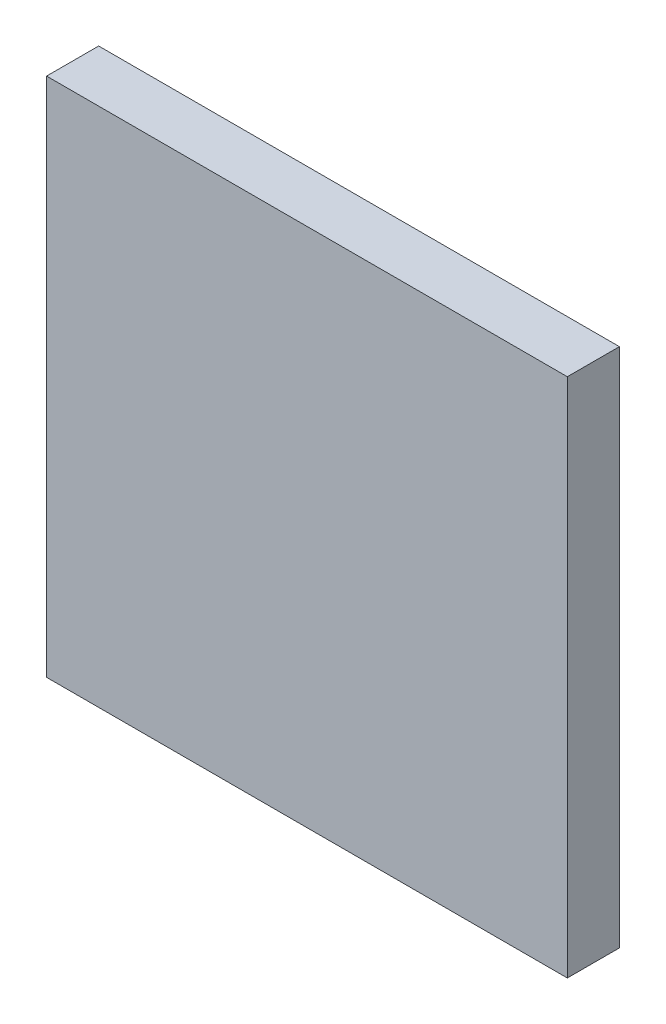
ISO-10303-21;
HEADER;
FILE_DESCRIPTION(('STEP AP214'),'2;1');
FILE_NAME('part.step','',(''),(''),'','','');
FILE_SCHEMA(('AUTOMOTIVE_DESIGN { 1 0 10303 214 1 1 1 1 }'));
ENDSEC;
DATA;
#1=APPLICATION_CONTEXT('core data for automotive mechanical design processes');
#2=APPLICATION_PROTOCOL_DEFINITION('international standard','automotive_design',2000,#1);
#3=PRODUCT_CONTEXT('',#1,'mechanical');
#4=PRODUCT('Part','Part','',(#3));
#5=PRODUCT_RELATED_PRODUCT_CATEGORY('part','',(#4));
#6=PRODUCT_DEFINITION_FORMATION('','',#4);
#7=PRODUCT_DEFINITION_CONTEXT('part definition',#1,'design');
#8=PRODUCT_DEFINITION('design','',#6,#7);
#9=PRODUCT_DEFINITION_SHAPE('','',#8);
#10=(LENGTH_UNIT() NAMED_UNIT(*) SI_UNIT(.MILLI.,.METRE.));
#11=(NAMED_UNIT(*) PLANE_ANGLE_UNIT() SI_UNIT($,.RADIAN.));
#12=(NAMED_UNIT(*) SI_UNIT($,.STERADIAN.) SOLID_ANGLE_UNIT());
#13=UNCERTAINTY_MEASURE_WITH_UNIT(LENGTH_MEASURE(1.E-05),#10,'distance_accuracy_value','');
#14=(GEOMETRIC_REPRESENTATION_CONTEXT(3) GLOBAL_UNCERTAINTY_ASSIGNED_CONTEXT((#13)) GLOBAL_UNIT_ASSIGNED_CONTEXT((#10,
#11,#12)) REPRESENTATION_CONTEXT('',''));
#15=CARTESIAN_POINT('',(0.,0.,0.));
#16=DIRECTION('',(0.,0.,1.));
#17=DIRECTION('',(1.,0.,0.));
#18=AXIS2_PLACEMENT_3D('',#15,#16,#17);
#19=CARTESIAN_POINT('',(10.,0.,1.));
#20=DIRECTION('',(0.,1.,0.));
#21=DIRECTION('',(0.,0.,1.));
#22=AXIS2_PLACEMENT_3D('',#19,#20,#21);
#23=PLANE('',#22);
#24=DIRECTION('',(1.,0.,0.));
#25=VECTOR('',#24,1.);
#26=CARTESIAN_POINT('',(10.,0.,0.));
#27=LINE('',#26,#25);
#28=CARTESIAN_POINT('',(0.,0.,0.));
#29=VERTEX_POINT('',#28);
#30=CARTESIAN_POINT('',(10.,0.,0.));
#31=VERTEX_POINT('',#30);
#32=EDGE_CURVE('E100',#29,#31,#27,.T.);
#33=ORIENTED_EDGE('',*,*,#32,.T.);
#34=DIRECTION('',(0.,0.,-1.));
#35=VECTOR('',#34,1.);
#36=CARTESIAN_POINT('',(10.,0.,1.));
#37=LINE('',#36,#35);
#38=CARTESIAN_POINT('',(10.,0.,1.));
#39=VERTEX_POINT('',#38);
#40=EDGE_CURVE('E11',#39,#31,#37,.T.);
#41=ORIENTED_EDGE('',*,*,#40,.F.);
#42=DIRECTION('',(1.,0.,0.));
#43=VECTOR('',#42,1.);
#44=CARTESIAN_POINT('',(10.,0.,1.));
#45=LINE('',#44,#43);
#46=CARTESIAN_POINT('',(0.,0.,1.));
#47=VERTEX_POINT('',#46);
#48=EDGE_CURVE('E88',#47,#39,#45,.T.);
#49=ORIENTED_EDGE('',*,*,#48,.F.);
#50=DIRECTION('',(0.,0.,-1.));
#51=VECTOR('',#50,1.);
#52=CARTESIAN_POINT('',(0.,0.,1.));
#53=LINE('',#52,#51);
#54=EDGE_CURVE('E96',#47,#29,#53,.T.);
#55=ORIENTED_EDGE('',*,*,#54,.T.);
#56=EDGE_LOOP('',(#33,#41,#49,#55));
#57=FACE_BOUND('',#56,.T.);
#58=ADVANCED_FACE('F37',(#57),#23,.F.);
#59=CARTESIAN_POINT('',(10.,10.,1.));
#60=DIRECTION('',(-1.,0.,0.));
#61=DIRECTION('',(0.,0.,1.));
#62=AXIS2_PLACEMENT_3D('',#59,#60,#61);
#63=PLANE('',#62);
#64=DIRECTION('',(0.,1.,0.));
#65=VECTOR('',#64,1.);
#66=CARTESIAN_POINT('',(10.,10.,0.));
#67=LINE('',#66,#65);
#68=CARTESIAN_POINT('',(10.,10.,0.));
#69=VERTEX_POINT('',#68);
#70=EDGE_CURVE('E92',#31,#69,#67,.T.);
#71=ORIENTED_EDGE('',*,*,#70,.T.);
#72=DIRECTION('',(0.,0.,-1.));
#73=VECTOR('',#72,1.);
#74=CARTESIAN_POINT('',(10.,10.,1.));
#75=LINE('',#74,#73);
#76=CARTESIAN_POINT('',(10.,10.,1.));
#77=VERTEX_POINT('',#76);
#78=EDGE_CURVE('E45',#77,#69,#75,.T.);
#79=ORIENTED_EDGE('',*,*,#78,.F.);
#80=DIRECTION('',(0.,1.,0.));
#81=VECTOR('',#80,1.);
#82=CARTESIAN_POINT('',(10.,10.,1.));
#83=LINE('',#82,#81);
#84=EDGE_CURVE('E83',#39,#77,#83,.T.);
#85=ORIENTED_EDGE('',*,*,#84,.F.);
#86=ORIENTED_EDGE('',*,*,#40,.T.);
#87=EDGE_LOOP('',(#71,#79,#85,#86));
#88=FACE_BOUND('',#87,.T.);
#89=ADVANCED_FACE('F91',(#88),#63,.F.);
#90=CARTESIAN_POINT('',(0.,10.,1.));
#91=DIRECTION('',(0.,-1.,0.));
#92=DIRECTION('',(0.,0.,-1.));
#93=AXIS2_PLACEMENT_3D('',#90,#91,#92);
#94=PLANE('',#93);
#95=DIRECTION('',(-1.,0.,0.));
#96=VECTOR('',#95,1.);
#97=CARTESIAN_POINT('',(0.,10.,0.));
#98=LINE('',#97,#96);
#99=CARTESIAN_POINT('',(0.,10.,0.));
#100=VERTEX_POINT('',#99);
#101=EDGE_CURVE('E70',#69,#100,#98,.T.);
#102=ORIENTED_EDGE('',*,*,#101,.T.);
#103=DIRECTION('',(0.,0.,-1.));
#104=VECTOR('',#103,1.);
#105=CARTESIAN_POINT('',(0.,10.,1.));
#106=LINE('',#105,#104);
#107=CARTESIAN_POINT('',(0.,10.,1.));
#108=VERTEX_POINT('',#107);
#109=EDGE_CURVE('E93',#108,#100,#106,.T.);
#110=ORIENTED_EDGE('',*,*,#109,.F.);
#111=DIRECTION('',(-1.,0.,0.));
#112=VECTOR('',#111,1.);
#113=CARTESIAN_POINT('',(0.,10.,1.));
#114=LINE('',#113,#112);
#115=EDGE_CURVE('E86',#77,#108,#114,.T.);
#116=ORIENTED_EDGE('',*,*,#115,.F.);
#117=ORIENTED_EDGE('',*,*,#78,.T.);
#118=EDGE_LOOP('',(#102,#110,#116,#117));
#119=FACE_BOUND('',#118,.T.);
#120=ADVANCED_FACE('F94',(#119),#94,.F.);
#121=CARTESIAN_POINT('',(0.,0.,1.));
#122=DIRECTION('',(1.,0.,0.));
#123=DIRECTION('',(0.,0.,-1.));
#124=AXIS2_PLACEMENT_3D('',#121,#122,#123);
#125=PLANE('',#124);
#126=DIRECTION('',(0.,-1.,0.));
#127=VECTOR('',#126,1.);
#128=CARTESIAN_POINT('',(0.,0.,0.));
#129=LINE('',#128,#127);
#130=EDGE_CURVE('E76',#100,#29,#129,.T.);
#131=ORIENTED_EDGE('',*,*,#130,.T.);
#132=ORIENTED_EDGE('',*,*,#54,.F.);
#133=DIRECTION('',(0.,-1.,0.));
#134=VECTOR('',#133,1.);
#135=CARTESIAN_POINT('',(0.,0.,1.));
#136=LINE('',#135,#134);
#137=EDGE_CURVE('E53',#108,#47,#136,.T.);
#138=ORIENTED_EDGE('',*,*,#137,.F.);
#139=ORIENTED_EDGE('',*,*,#109,.T.);
#140=EDGE_LOOP('',(#131,#132,#138,#139));
#141=FACE_BOUND('',#140,.T.);
#142=ADVANCED_FACE('F107',(#141),#125,.F.);
#143=CARTESIAN_POINT('',(0.,0.,1.));
#144=DIRECTION('',(0.,0.,-1.));
#145=DIRECTION('',(-1.,0.,0.));
#146=AXIS2_PLACEMENT_3D('',#143,#144,#145);
#147=PLANE('',#146);
#148=ORIENTED_EDGE('',*,*,#48,.T.);
#149=ORIENTED_EDGE('',*,*,#84,.T.);
#150=ORIENTED_EDGE('',*,*,#115,.T.);
#151=ORIENTED_EDGE('',*,*,#137,.T.);
#152=EDGE_LOOP('',(#148,#149,#150,#151));
#153=FACE_BOUND('',#152,.T.);
#154=ADVANCED_FACE('F84',(#153),#147,.F.);
#155=CARTESIAN_POINT('',(0.,0.,0.));
#156=DIRECTION('',(0.,0.,-1.));
#157=DIRECTION('',(-1.,0.,0.));
#158=AXIS2_PLACEMENT_3D('',#155,#156,#157);
#159=PLANE('',#158);
#160=ORIENTED_EDGE('',*,*,#32,.F.);
#161=ORIENTED_EDGE('',*,*,#130,.F.);
#162=ORIENTED_EDGE('',*,*,#101,.F.);
#163=ORIENTED_EDGE('',*,*,#70,.F.);
#164=EDGE_LOOP('',(#160,#161,#162,#163));
#165=FACE_BOUND('',#164,.T.);
#166=ADVANCED_FACE('F110',(#165),#159,.T.);
#167=CLOSED_SHELL('',(#58,#89,#120,#142,#154,#166));
#168=MANIFOLD_SOLID_BREP('B2',#167);
#169=ADVANCED_BREP_SHAPE_REPRESENTATION('',(#18,#168),#14);
#170=SHAPE_DEFINITION_REPRESENTATION(#9,#169);
ENDSEC;
END-ISO-10303-21;
